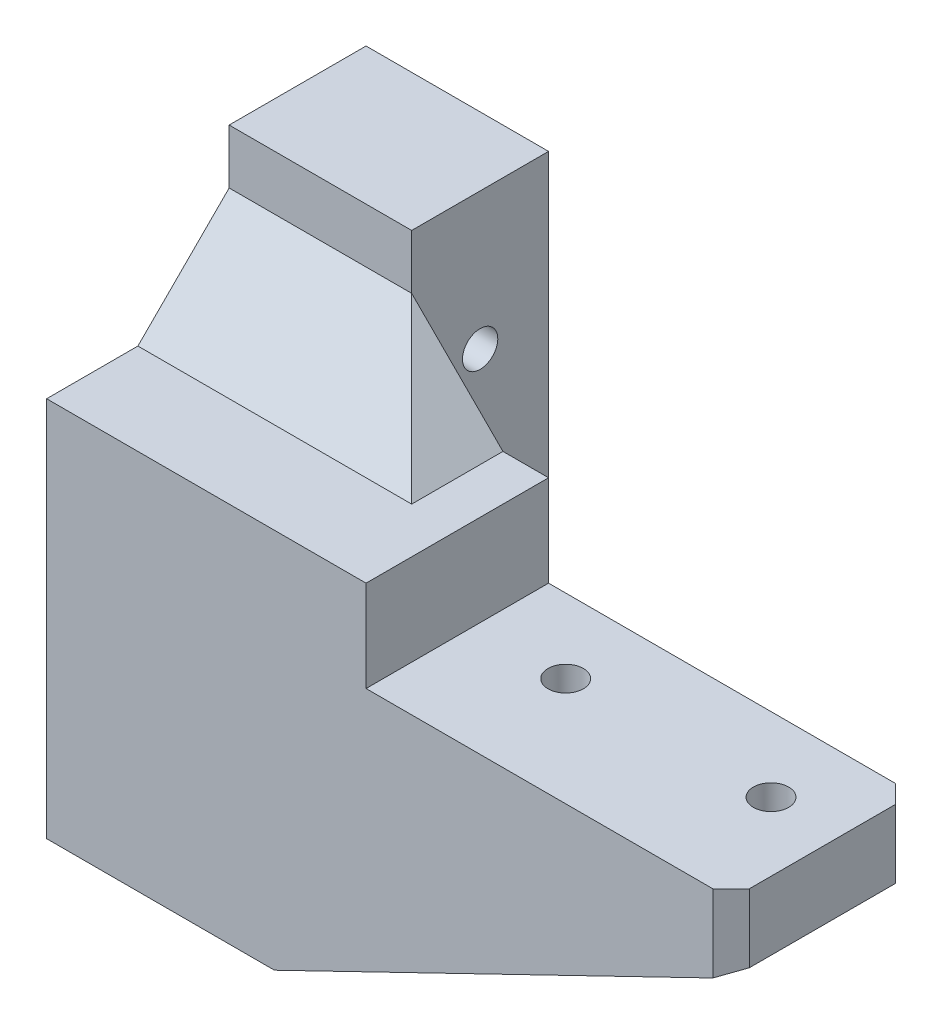
ISO-10303-21;
HEADER;
FILE_DESCRIPTION(('STEP AP214'),'2;1');
FILE_NAME('part.step','',(''),(''),'','','');
FILE_SCHEMA(('AUTOMOTIVE_DESIGN { 1 0 10303 214 1 1 1 1 }'));
ENDSEC;
DATA;
#1=APPLICATION_CONTEXT('core data for automotive mechanical design processes');
#2=APPLICATION_PROTOCOL_DEFINITION('international standard','automotive_design',2000,#1);
#3=PRODUCT_CONTEXT('',#1,'mechanical');
#4=PRODUCT('Part','Part','',(#3));
#5=PRODUCT_RELATED_PRODUCT_CATEGORY('part','',(#4));
#6=PRODUCT_DEFINITION_FORMATION('','',#4);
#7=PRODUCT_DEFINITION_CONTEXT('part definition',#1,'design');
#8=PRODUCT_DEFINITION('design','',#6,#7);
#9=PRODUCT_DEFINITION_SHAPE('','',#8);
#10=(LENGTH_UNIT() NAMED_UNIT(*) SI_UNIT(.MILLI.,.METRE.));
#11=(NAMED_UNIT(*) PLANE_ANGLE_UNIT() SI_UNIT($,.RADIAN.));
#12=(NAMED_UNIT(*) SI_UNIT($,.STERADIAN.) SOLID_ANGLE_UNIT());
#13=UNCERTAINTY_MEASURE_WITH_UNIT(LENGTH_MEASURE(1.E-05),#10,'distance_accuracy_value','');
#14=(GEOMETRIC_REPRESENTATION_CONTEXT(3) GLOBAL_UNCERTAINTY_ASSIGNED_CONTEXT((#13)) GLOBAL_UNIT_ASSIGNED_CONTEXT((#10,
#11,#12)) REPRESENTATION_CONTEXT('',''));
#15=CARTESIAN_POINT('',(0.,0.,0.));
#16=DIRECTION('',(0.,0.,1.));
#17=DIRECTION('',(1.,0.,0.));
#18=AXIS2_PLACEMENT_3D('',#15,#16,#17);
#19=CARTESIAN_POINT('',(95.2499999999948,-202.564999999986,33.3375000000001));
#20=DIRECTION('',(0.,0.707106781186556,0.707106781186546));
#21=DIRECTION('',(1.,0.,0.));
#22=AXIS2_PLACEMENT_3D('',#19,#20,#21);
#23=PLANE('',#22);
#24=CARTESIAN_POINT('',(85.7250000000001,-198.596249999989,29.3687500000002));
#25=DIRECTION('',(0.,-0.707106781186556,-0.707106781186546));
#26=DIRECTION('',(0.,0.707106781186545,-0.707106781186552));
#27=AXIS2_PLACEMENT_3D('',#24,#25,#26);
#28=ELLIPSE('',#27,8.9802561210691,6.35);
#29=CARTESIAN_POINT('',(90.6819671612285,-202.564999999988,33.3375));
#30=VERTEX_POINT('',#29);
#31=CARTESIAN_POINT('',(80.7680328387735,-202.564999999989,33.3374999999999));
#32=VERTEX_POINT('',#31);
#33=EDGE_CURVE('E182',#30,#32,#28,.T.);
#34=ORIENTED_EDGE('',*,*,#33,.F.);
#35=DIRECTION('',(1.,0.,0.));
#36=VECTOR('',#35,1.);
#37=CARTESIAN_POINT('',(95.2499999999948,-202.564999999986,33.3375000000001));
#38=LINE('',#37,#36);
#39=CARTESIAN_POINT('',(95.2499999999948,-202.564999999986,33.3375000000001));
#40=VERTEX_POINT('',#39);
#41=EDGE_CURVE('E179',#30,#40,#38,.T.);
#42=ORIENTED_EDGE('',*,*,#41,.T.);
#43=DIRECTION('',(-0.824876446835019,-0.399736692997301,0.399736692997305));
#44=VECTOR('',#43,1.);
#45=CARTESIAN_POINT('',(95.2499999999948,-202.564999999986,33.3375000000001));
#46=LINE('',#45,#44);
#47=CARTESIAN_POINT('',(82.146460772397,-208.914999999989,39.6874999999997));
#48=VERTEX_POINT('',#47);
#49=EDGE_CURVE('E11',#40,#48,#46,.T.);
#50=ORIENTED_EDGE('',*,*,#49,.T.);
#51=DIRECTION('',(-1.,0.,0.));
#52=VECTOR('',#51,1.);
#53=CARTESIAN_POINT('',(0.,-208.914999999988,39.6874999999998));
#54=LINE('',#53,#52);
#55=CARTESIAN_POINT('',(44.8225263736664,-208.914999999988,39.6874999999996));
#56=VERTEX_POINT('',#55);
#57=EDGE_CURVE('E359',#48,#56,#54,.T.);
#58=ORIENTED_EDGE('',*,*,#57,.T.);
#59=DIRECTION('',(0.41596662095865,0.643028681416405,-0.64302868141641));
#60=VECTOR('',#59,1.);
#61=CARTESIAN_POINT('',(48.9302561210705,-202.564999999988,33.3375));
#62=LINE('',#61,#60);
#63=CARTESIAN_POINT('',(48.9302561210705,-202.564999999988,33.3375));
#64=VERTEX_POINT('',#63);
#65=EDGE_CURVE('E316',#56,#64,#62,.T.);
#66=ORIENTED_EDGE('',*,*,#65,.T.);
#67=CARTESIAN_POINT('',(52.1930328387672,-202.564999999985,33.3375000000001));
#68=VERTEX_POINT('',#67);
#69=EDGE_CURVE('E187',#64,#68,#38,.T.);
#70=ORIENTED_EDGE('',*,*,#69,.T.);
#71=CARTESIAN_POINT('',(57.1500000000001,-198.596249999988,29.3687500000001));
#72=DIRECTION('',(0.,-0.707106781186556,-0.707106781186546));
#73=DIRECTION('',(0.,0.707106781186545,-0.707106781186552));
#74=AXIS2_PLACEMENT_3D('',#71,#72,#73);
#75=ELLIPSE('',#74,8.98025612106912,6.35000000000001);
#76=CARTESIAN_POINT('',(62.1069671612249,-202.564999999988,33.3375000000001));
#77=VERTEX_POINT('',#76);
#78=EDGE_CURVE('E186',#77,#68,#75,.T.);
#79=ORIENTED_EDGE('',*,*,#78,.F.);
#80=EDGE_CURVE('E175',#77,#32,#38,.T.);
#81=ORIENTED_EDGE('',*,*,#80,.T.);
#82=EDGE_LOOP('',(#34,#42,#50,#58,#66,#70,#79,#81));
#83=FACE_BOUND('',#82,.T.);
#84=ADVANCED_FACE('F33',(#83),#23,.F.);
#85=CARTESIAN_POINT('',(25.399999999995,-160.055836743415,44.4500000000005));
#86=DIRECTION('',(0.,1.,0.));
#87=DIRECTION('',(0.,0.,-1.));
#88=AXIS2_PLACEMENT_3D('',#85,#86,#87);
#89=PLANE('',#88);
#90=DIRECTION('',(0.,0.,-1.));
#91=VECTOR('',#90,1.);
#92=CARTESIAN_POINT('',(25.399999999995,-160.055836743415,44.4500000000005));
#93=LINE('',#92,#91);
#94=CARTESIAN_POINT('',(25.399999999995,-160.055836743415,19.0500000000005));
#95=VERTEX_POINT('',#94);
#96=CARTESIAN_POINT('',(25.399999999995,-160.055836743415,0.));
#97=VERTEX_POINT('',#96);
#98=EDGE_CURVE('E301',#95,#97,#93,.T.);
#99=ORIENTED_EDGE('',*,*,#98,.T.);
#100=DIRECTION('',(-1.,0.,0.));
#101=VECTOR('',#100,1.);
#102=CARTESIAN_POINT('',(25.399999999995,-160.055836743415,0.));
#103=LINE('',#102,#101);
#104=CARTESIAN_POINT('',(0.,-160.055836743415,-2.4980018054066E-13));
#105=VERTEX_POINT('',#104);
#106=EDGE_CURVE('E285',#97,#105,#103,.T.);
#107=ORIENTED_EDGE('',*,*,#106,.T.);
#108=DIRECTION('',(0.,0.,-1.));
#109=VECTOR('',#108,1.);
#110=CARTESIAN_POINT('',(0.,-160.055836743415,44.4499999999998));
#111=LINE('',#110,#109);
#112=CARTESIAN_POINT('',(0.,-160.055836743415,19.0499999999998));
#113=VERTEX_POINT('',#112);
#114=EDGE_CURVE('E297',#113,#105,#111,.T.);
#115=ORIENTED_EDGE('',*,*,#114,.F.);
#116=DIRECTION('',(-1.,0.,0.));
#117=VECTOR('',#116,1.);
#118=CARTESIAN_POINT('',(60.3249999999998,-160.055836743415,19.0499999999998));
#119=LINE('',#118,#117);
#120=EDGE_CURVE('E227',#95,#113,#119,.T.);
#121=ORIENTED_EDGE('',*,*,#120,.F.);
#122=EDGE_LOOP('',(#99,#107,#115,#121));
#123=FACE_BOUND('',#122,.T.);
#124=ADVANCED_FACE('F393',(#123),#89,.T.);
#125=CARTESIAN_POINT('',(31.6978347460992,-233.362499999998,19.05));
#126=DIRECTION('',(0.965925826289074,-0.258819045102523,0.));
#127=DIRECTION('',(0.258819045102522,0.965925826289074,0.));
#128=AXIS2_PLACEMENT_3D('',#125,#126,#127);
#129=PLANE('',#128);
#130=DIRECTION('',(0.258819045102522,0.965925826289074,0.));
#131=VECTOR('',#130,1.);
#132=CARTESIAN_POINT('',(31.6978347460992,-233.362499999998,33.3375000000001));
#133=LINE('',#132,#131);
#134=CARTESIAN_POINT('',(31.6978347460992,-233.362499999998,33.3375000000001));
#135=VERTEX_POINT('',#134);
#136=CARTESIAN_POINT('',(38.3064990635998,-208.698628996924,33.3374999999997));
#137=VERTEX_POINT('',#136);
#138=EDGE_CURVE('E353',#135,#137,#133,.T.);
#139=ORIENTED_EDGE('',*,*,#138,.F.);
#140=DIRECTION('',(0.,0.,1.));
#141=VECTOR('',#140,1.);
#142=CARTESIAN_POINT('',(31.6978347460992,-233.362499999998,19.05));
#143=LINE('',#142,#141);
#144=CARTESIAN_POINT('',(31.6978347460992,-233.362499999998,19.05));
#145=VERTEX_POINT('',#144);
#146=EDGE_CURVE('E274',#145,#135,#143,.T.);
#147=ORIENTED_EDGE('',*,*,#146,.F.);
#148=DIRECTION('',(-0.258819045102522,-0.965925826289069,0.));
#149=VECTOR('',#148,1.);
#150=CARTESIAN_POINT('',(31.6978347460992,-233.362499999998,19.05));
#151=LINE('',#150,#149);
#152=CARTESIAN_POINT('',(38.3064990635997,-208.698628996924,19.0500000000001));
#153=VERTEX_POINT('',#152);
#154=EDGE_CURVE('E253',#153,#145,#151,.T.);
#155=ORIENTED_EDGE('',*,*,#154,.F.);
#156=DIRECTION('',(0.,0.,-1.));
#157=VECTOR('',#156,1.);
#158=CARTESIAN_POINT('',(38.3064990635997,-208.698628996924,19.0500000000001));
#159=LINE('',#158,#157);
#160=EDGE_CURVE('E356',#137,#153,#159,.T.);
#161=ORIENTED_EDGE('',*,*,#160,.F.);
#162=EDGE_LOOP('',(#139,#147,#155,#161));
#163=FACE_BOUND('',#162,.T.);
#164=ADVANCED_FACE('F397',(#163),#129,.T.);
#165=CARTESIAN_POINT('',(95.2499999999948,-202.564999999986,19.0500000000001));
#166=DIRECTION('',(0.,-1.,0.));
#167=DIRECTION('',(0.,0.,1.));
#168=AXIS2_PLACEMENT_3D('',#165,#166,#167);
#169=PLANE('',#168);
#170=CARTESIAN_POINT('',(85.7250000000001,-202.564999999989,29.36875));
#171=DIRECTION('',(0.,1.,0.));
#172=DIRECTION('',(0.,0.,1.));
#173=AXIS2_PLACEMENT_3D('',#170,#171,#172);
#174=CIRCLE('',#173,2.45744999999999);
#175=CARTESIAN_POINT('',(85.7250000000001,-202.564999999989,31.8262));
#176=VERTEX_POINT('',#175);
#177=EDGE_CURVE('E181',#176,#176,#174,.T.);
#178=ORIENTED_EDGE('',*,*,#177,.T.);
#179=EDGE_LOOP('',(#178));
#180=FACE_BOUND('',#179,.T.);
#181=CARTESIAN_POINT('',(57.15,-202.564999999989,29.36875));
#182=DIRECTION('',(0.,1.,0.));
#183=DIRECTION('',(0.,0.,1.));
#184=AXIS2_PLACEMENT_3D('',#181,#182,#183);
#185=CIRCLE('',#184,2.45744999999999);
#186=CARTESIAN_POINT('',(57.15,-202.564999999989,31.8262));
#187=VERTEX_POINT('',#186);
#188=EDGE_CURVE('E196',#187,#187,#185,.T.);
#189=ORIENTED_EDGE('',*,*,#188,.T.);
#190=EDGE_LOOP('',(#189));
#191=FACE_BOUND('',#190,.T.);
#192=DIRECTION('',(-1.,0.,0.));
#193=VECTOR('',#192,1.);
#194=CARTESIAN_POINT('',(95.2499999999948,-202.564999999986,19.0500000000001));
#195=LINE('',#194,#193);
#196=CARTESIAN_POINT('',(92.7100000000003,-202.564999999989,19.05));
#197=VERTEX_POINT('',#196);
#198=CARTESIAN_POINT('',(48.9302561210705,-202.564999999988,19.05));
#199=VERTEX_POINT('',#198);
#200=EDGE_CURVE('E249',#197,#199,#195,.T.);
#201=ORIENTED_EDGE('',*,*,#200,.F.);
#202=DIRECTION('',(-0.707106781186552,0.,-0.707106781186547));
#203=VECTOR('',#202,1.);
#204=CARTESIAN_POINT('',(93.9800000000002,-202.564999999989,20.3200000000001));
#205=LINE('',#204,#203);
#206=CARTESIAN_POINT('',(95.2499999999948,-202.564999999986,21.5900000000002));
#207=VERTEX_POINT('',#206);
#208=EDGE_CURVE('E345',#207,#197,#205,.T.);
#209=ORIENTED_EDGE('',*,*,#208,.F.);
#210=DIRECTION('',(0.,0.,1.));
#211=VECTOR('',#210,1.);
#212=CARTESIAN_POINT('',(95.2499999999948,-202.564999999986,19.0500000000001));
#213=LINE('',#212,#211);
#214=EDGE_CURVE('E277',#207,#40,#213,.T.);
#215=ORIENTED_EDGE('',*,*,#214,.T.);
#216=ORIENTED_EDGE('',*,*,#41,.F.);
#217=CARTESIAN_POINT('',(85.7250000000001,-202.564999999989,29.36875));
#218=DIRECTION('',(0.,1.,0.));
#219=DIRECTION('',(0.,0.,1.));
#220=AXIS2_PLACEMENT_3D('',#217,#218,#219);
#221=CIRCLE('',#220,6.35);
#222=EDGE_CURVE('E48',#32,#30,#221,.T.);
#223=ORIENTED_EDGE('',*,*,#222,.F.);
#224=ORIENTED_EDGE('',*,*,#80,.F.);
#225=CARTESIAN_POINT('',(57.15,-202.564999999989,29.36875));
#226=DIRECTION('',(0.,1.,0.));
#227=DIRECTION('',(0.,0.,1.));
#228=AXIS2_PLACEMENT_3D('',#225,#226,#227);
#229=CIRCLE('',#228,6.35000000000001);
#230=EDGE_CURVE('E55',#68,#77,#229,.T.);
#231=ORIENTED_EDGE('',*,*,#230,.F.);
#232=ORIENTED_EDGE('',*,*,#69,.F.);
#233=DIRECTION('',(0.,0.,1.));
#234=VECTOR('',#233,1.);
#235=CARTESIAN_POINT('',(48.9302561210705,-202.564999999988,39.6875000000001));
#236=LINE('',#235,#234);
#237=EDGE_CURVE('E350',#199,#64,#236,.T.);
#238=ORIENTED_EDGE('',*,*,#237,.F.);
#239=EDGE_LOOP('',(#201,#209,#215,#216,#223,#224,#231,#232,#238));
#240=FACE_BOUND('',#239,.T.);
#241=ADVANCED_FACE('F174',(#180,#191,#240),#169,.T.);
#242=CARTESIAN_POINT('',(25.399999999995,-160.055836743415,44.4500000000005));
#243=DIRECTION('',(1.,0.,0.));
#244=DIRECTION('',(0.,1.00000000000001,0.));
#245=AXIS2_PLACEMENT_3D('',#242,#243,#244);
#246=PLANE('',#245);
#247=CARTESIAN_POINT('',(25.3999999999976,-214.312500000004,9.52499999999959));
#248=DIRECTION('',(-1.,0.,0.));
#249=DIRECTION('',(0.,1.00000000000001,0.));
#250=AXIS2_PLACEMENT_3D('',#247,#248,#249);
#251=CIRCLE('',#250,2.45744999999999);
#252=CARTESIAN_POINT('',(25.3999999999976,-211.855050000004,9.52499999999959));
#253=VERTEX_POINT('',#252);
#254=EDGE_CURVE('E203',#253,#253,#251,.T.);
#255=ORIENTED_EDGE('',*,*,#254,.T.);
#256=EDGE_LOOP('',(#255));
#257=FACE_BOUND('',#256,.T.);
#258=CARTESIAN_POINT('',(25.3999999999995,-179.105836743418,9.52499999999998));
#259=DIRECTION('',(-1.,0.,0.));
#260=DIRECTION('',(0.,1.00000000000001,0.));
#261=AXIS2_PLACEMENT_3D('',#258,#259,#260);
#262=CIRCLE('',#261,2.45744999999999);
#263=CARTESIAN_POINT('',(25.3999999999995,-176.648386743418,9.52499999999998));
#264=VERTEX_POINT('',#263);
#265=EDGE_CURVE('E208',#264,#264,#262,.T.);
#266=ORIENTED_EDGE('',*,*,#265,.T.);
#267=EDGE_LOOP('',(#266));
#268=FACE_BOUND('',#267,.T.);
#269=DIRECTION('',(0.,1.00000000000001,0.));
#270=VECTOR('',#269,1.);
#271=CARTESIAN_POINT('',(25.4000000000003,-233.362500000001,19.0499999999999));
#272=LINE('',#271,#270);
#273=CARTESIAN_POINT('',(25.4000000000003,-233.362500000001,19.0499999999999));
#274=VERTEX_POINT('',#273);
#275=CARTESIAN_POINT('',(25.4000000000003,-167.639999999989,19.05));
#276=VERTEX_POINT('',#275);
#277=EDGE_CURVE('E259',#274,#276,#272,.T.);
#278=ORIENTED_EDGE('',*,*,#277,.F.);
#279=DIRECTION('',(0.,0.,-1.));
#280=VECTOR('',#279,1.);
#281=CARTESIAN_POINT('',(25.4000000000003,-233.362500000001,44.4499999999999));
#282=LINE('',#281,#280);
#283=CARTESIAN_POINT('',(25.4000000000003,-233.362500000001,-2.4980018054066E-13));
#284=VERTEX_POINT('',#283);
#285=EDGE_CURVE('E304',#274,#284,#282,.T.);
#286=ORIENTED_EDGE('',*,*,#285,.T.);
#287=DIRECTION('',(0.,1.00000000000001,0.));
#288=VECTOR('',#287,1.);
#289=CARTESIAN_POINT('',(25.399999999995,-160.055836743415,0.));
#290=LINE('',#289,#288);
#291=EDGE_CURVE('E293',#284,#97,#290,.T.);
#292=ORIENTED_EDGE('',*,*,#291,.T.);
#293=ORIENTED_EDGE('',*,*,#98,.F.);
#294=EDGE_CURVE('E258',#276,#95,#272,.T.);
#295=ORIENTED_EDGE('',*,*,#294,.F.);
#296=EDGE_LOOP('',(#278,#286,#292,#293,#295));
#297=FACE_BOUND('',#296,.T.);
#298=ADVANCED_FACE('F409',(#257,#268,#297),#246,.T.);
#299=CARTESIAN_POINT('',(0.,-160.055836743415,44.4499999999998));
#300=DIRECTION('',(-1.,0.,0.));
#301=DIRECTION('',(0.,-1.,0.));
#302=AXIS2_PLACEMENT_3D('',#299,#300,#301);
#303=PLANE('',#302);
#304=CARTESIAN_POINT('',(0.,-179.105836743417,9.52500000000006));
#305=DIRECTION('',(1.,0.,0.));
#306=DIRECTION('',(0.,0.,-1.));
#307=AXIS2_PLACEMENT_3D('',#304,#305,#306);
#308=CIRCLE('',#307,2.95910000000002);
#309=CARTESIAN_POINT('',(0.,-179.105836743417,6.56590000000004));
#310=VERTEX_POINT('',#309);
#311=EDGE_CURVE('E211',#310,#310,#308,.T.);
#312=ORIENTED_EDGE('',*,*,#311,.T.);
#313=EDGE_LOOP('',(#312));
#314=FACE_BOUND('',#313,.T.);
#315=CARTESIAN_POINT('',(-8.60422844084496E-13,-214.312500000004,9.5249999999997));
#316=DIRECTION('',(1.,0.,0.));
#317=DIRECTION('',(0.,0.,-1.));
#318=AXIS2_PLACEMENT_3D('',#315,#316,#317);
#319=CIRCLE('',#318,2.95910000000002);
#320=CARTESIAN_POINT('',(-8.6107989627493E-13,-214.312500000004,6.56589999999967));
#321=VERTEX_POINT('',#320);
#322=EDGE_CURVE('E217',#321,#321,#319,.T.);
#323=ORIENTED_EDGE('',*,*,#322,.T.);
#324=EDGE_LOOP('',(#323));
#325=FACE_BOUND('',#324,.T.);
#326=DIRECTION('',(0.,-1.,0.));
#327=VECTOR('',#326,1.);
#328=CARTESIAN_POINT('',(-7.06379399417756E-12,-180.339999999986,19.05));
#329=LINE('',#328,#327);
#330=CARTESIAN_POINT('',(-3.5527136788005E-12,-167.639999999987,19.0499999999997));
#331=VERTEX_POINT('',#330);
#332=EDGE_CURVE('E224',#113,#331,#329,.T.);
#333=ORIENTED_EDGE('',*,*,#332,.F.);
#334=ORIENTED_EDGE('',*,*,#114,.T.);
#335=DIRECTION('',(0.,-1.,0.));
#336=VECTOR('',#335,1.);
#337=CARTESIAN_POINT('',(0.,-160.055836743415,-2.4980018054066E-13));
#338=LINE('',#337,#336);
#339=CARTESIAN_POINT('',(0.,-233.3625,0.));
#340=VERTEX_POINT('',#339);
#341=EDGE_CURVE('E271',#105,#340,#338,.T.);
#342=ORIENTED_EDGE('',*,*,#341,.T.);
#343=DIRECTION('',(0.,0.,-1.));
#344=VECTOR('',#343,1.);
#345=CARTESIAN_POINT('',(0.,-233.3625,44.45));
#346=LINE('',#345,#344);
#347=CARTESIAN_POINT('',(0.,-233.3625,44.45));
#348=VERTEX_POINT('',#347);
#349=EDGE_CURVE('E288',#348,#340,#346,.T.);
#350=ORIENTED_EDGE('',*,*,#349,.F.);
#351=DIRECTION('',(0.,-1.,0.));
#352=VECTOR('',#351,1.);
#353=CARTESIAN_POINT('',(0.,-160.055836743415,44.4499999999998));
#354=LINE('',#353,#352);
#355=CARTESIAN_POINT('',(-7.105427357601E-12,-180.339999999986,44.4500000000001));
#356=VERTEX_POINT('',#355);
#357=EDGE_CURVE('E281',#356,#348,#354,.T.);
#358=ORIENTED_EDGE('',*,*,#357,.F.);
#359=DIRECTION('',(0.,0.,1.));
#360=VECTOR('',#359,1.);
#361=CARTESIAN_POINT('',(-7.11930514540882E-12,-180.339999999986,-44.5939541827765));
#362=LINE('',#361,#360);
#363=CARTESIAN_POINT('',(-7.11930514540882E-12,-180.339999999986,31.7500000000001));
#364=VERTEX_POINT('',#363);
#365=EDGE_CURVE('E228',#364,#356,#362,.T.);
#366=ORIENTED_EDGE('',*,*,#365,.F.);
#367=DIRECTION('',(0.,-0.707106781186545,0.707106781186551));
#368=VECTOR('',#367,1.);
#369=CARTESIAN_POINT('',(-7.11930514540882E-12,-180.339999999986,31.7500000000001));
#370=LINE('',#369,#368);
#371=EDGE_CURVE('E321',#331,#364,#370,.T.);
#372=ORIENTED_EDGE('',*,*,#371,.F.);
#373=EDGE_LOOP('',(#333,#334,#342,#350,#358,#366,#372));
#374=FACE_BOUND('',#373,.T.);
#375=ADVANCED_FACE('F412',(#314,#325,#374),#303,.T.);
#376=CARTESIAN_POINT('',(25.4000000000003,-233.362500000001,44.4499999999999));
#377=DIRECTION('',(0.,-1.,0.));
#378=DIRECTION('',(0.,0.,1.));
#379=AXIS2_PLACEMENT_3D('',#376,#377,#378);
#380=PLANE('',#379);
#381=DIRECTION('',(1.,0.,0.));
#382=VECTOR('',#381,1.);
#383=CARTESIAN_POINT('',(25.4000000000003,-233.362500000001,-2.4980018054066E-13));
#384=LINE('',#383,#382);
#385=EDGE_CURVE('E291',#340,#284,#384,.T.);
#386=ORIENTED_EDGE('',*,*,#385,.T.);
#387=ORIENTED_EDGE('',*,*,#285,.F.);
#388=DIRECTION('',(-1.,0.,0.));
#389=VECTOR('',#388,1.);
#390=CARTESIAN_POINT('',(25.4000000000003,-233.362500000001,19.0499999999999));
#391=LINE('',#390,#389);
#392=EDGE_CURVE('E256',#145,#274,#391,.T.);
#393=ORIENTED_EDGE('',*,*,#392,.F.);
#394=ORIENTED_EDGE('',*,*,#146,.T.);
#395=DIRECTION('',(0.,0.,1.));
#396=VECTOR('',#395,1.);
#397=CARTESIAN_POINT('',(31.6978347460992,-233.362499999998,39.6875000000001));
#398=LINE('',#397,#396);
#399=CARTESIAN_POINT('',(31.6978347460992,-233.362499999999,44.4500000000001));
#400=VERTEX_POINT('',#399);
#401=EDGE_CURVE('E238',#135,#400,#398,.T.);
#402=ORIENTED_EDGE('',*,*,#401,.T.);
#403=DIRECTION('',(1.,0.,0.));
#404=VECTOR('',#403,1.);
#405=CARTESIAN_POINT('',(25.4000000000003,-233.362500000001,44.4499999999999));
#406=LINE('',#405,#404);
#407=EDGE_CURVE('E284',#348,#400,#406,.T.);
#408=ORIENTED_EDGE('',*,*,#407,.F.);
#409=ORIENTED_EDGE('',*,*,#349,.T.);
#410=EDGE_LOOP('',(#386,#387,#393,#394,#402,#408,#409));
#411=FACE_BOUND('',#410,.T.);
#412=ADVANCED_FACE('F414',(#411),#380,.T.);
#413=CARTESIAN_POINT('',(0.,0.,44.4499999999999));
#414=DIRECTION('',(0.,0.,1.));
#415=DIRECTION('',(-1.,0.,0.));
#416=AXIS2_PLACEMENT_3D('',#413,#414,#415);
#417=PLANE('',#416);
#418=DIRECTION('',(1.,0.,0.));
#419=VECTOR('',#418,1.);
#420=CARTESIAN_POINT('',(44.4500000000003,-193.039999999989,44.4500000000002));
#421=LINE('',#420,#419);
#422=CARTESIAN_POINT('',(44.4500000000003,-193.039999999989,44.4500000000002));
#423=VERTEX_POINT('',#422);
#424=CARTESIAN_POINT('',(92.7099999999994,-193.039999999988,44.4500000000001));
#425=VERTEX_POINT('',#424);
#426=EDGE_CURVE('E243',#423,#425,#421,.T.);
#427=ORIENTED_EDGE('',*,*,#426,.F.);
#428=DIRECTION('',(0.,-1.,0.));
#429=VECTOR('',#428,1.);
#430=CARTESIAN_POINT('',(44.4500000000003,-193.039999999989,44.4500000000002));
#431=LINE('',#430,#429);
#432=CARTESIAN_POINT('',(44.4499999999968,-180.339999999986,44.4500000000001));
#433=VERTEX_POINT('',#432);
#434=EDGE_CURVE('E250',#433,#423,#431,.T.);
#435=ORIENTED_EDGE('',*,*,#434,.F.);
#436=DIRECTION('',(-1.,0.,0.));
#437=VECTOR('',#436,1.);
#438=CARTESIAN_POINT('',(60.3249999999971,-180.339999999986,44.4500000000002));
#439=LINE('',#438,#437);
#440=EDGE_CURVE('E223',#433,#356,#439,.T.);
#441=ORIENTED_EDGE('',*,*,#440,.T.);
#442=ORIENTED_EDGE('',*,*,#357,.T.);
#443=ORIENTED_EDGE('',*,*,#407,.T.);
#444=DIRECTION('',(-0.89990120040365,-0.436093831086931,0.));
#445=VECTOR('',#444,1.);
#446=CARTESIAN_POINT('',(31.6978347460992,-233.362499999999,44.4500000000001));
#447=LINE('',#446,#445);
#448=CARTESIAN_POINT('',(92.7100000000003,-203.795888824744,44.4500000000001));
#449=VERTEX_POINT('',#448);
#450=EDGE_CURVE('E231',#449,#400,#447,.T.);
#451=ORIENTED_EDGE('',*,*,#450,.F.);
#452=DIRECTION('',(0.,-1.,0.));
#453=VECTOR('',#452,1.);
#454=CARTESIAN_POINT('',(92.7099999999994,2.22044604925031E-13,44.4500000000004));
#455=LINE('',#454,#453);
#456=EDGE_CURVE('E331',#425,#449,#455,.T.);
#457=ORIENTED_EDGE('',*,*,#456,.F.);
#458=EDGE_LOOP('',(#427,#435,#441,#442,#443,#451,#457));
#459=FACE_BOUND('',#458,.T.);
#460=ADVANCED_FACE('F417',(#459),#417,.T.);
#461=CARTESIAN_POINT('',(0.,0.,0.));
#462=DIRECTION('',(0.,0.,1.));
#463=DIRECTION('',(-1.,0.,0.));
#464=AXIS2_PLACEMENT_3D('',#461,#462,#463);
#465=PLANE('',#464);
#466=ORIENTED_EDGE('',*,*,#341,.F.);
#467=ORIENTED_EDGE('',*,*,#106,.F.);
#468=ORIENTED_EDGE('',*,*,#291,.F.);
#469=ORIENTED_EDGE('',*,*,#385,.F.);
#470=EDGE_LOOP('',(#466,#467,#468,#469));
#471=FACE_BOUND('',#470,.T.);
#472=ADVANCED_FACE('F407',(#471),#465,.F.);
#473=CARTESIAN_POINT('',(44.4500000000004,-193.039999999989,19.0500000000002));
#474=DIRECTION('',(0.,1.,0.));
#475=DIRECTION('',(0.,0.,-1.));
#476=AXIS2_PLACEMENT_3D('',#473,#474,#475);
#477=PLANE('',#476);
#478=CARTESIAN_POINT('',(85.724999999993,-193.039999999987,29.36875));
#479=DIRECTION('',(0.,-1.,0.));
#480=DIRECTION('',(0.,0.,-1.));
#481=AXIS2_PLACEMENT_3D('',#478,#479,#480);
#482=CIRCLE('',#481,2.45744999999999);
#483=CARTESIAN_POINT('',(85.724999999993,-193.039999999987,26.9113));
#484=VERTEX_POINT('',#483);
#485=EDGE_CURVE('E36',#484,#484,#482,.T.);
#486=ORIENTED_EDGE('',*,*,#485,.T.);
#487=EDGE_LOOP('',(#486));
#488=FACE_BOUND('',#487,.T.);
#489=CARTESIAN_POINT('',(57.1499999999859,-193.039999999985,29.3687500000001));
#490=DIRECTION('',(0.,-1.,0.));
#491=DIRECTION('',(0.,0.,-1.));
#492=AXIS2_PLACEMENT_3D('',#489,#490,#491);
#493=CIRCLE('',#492,2.45744999999999);
#494=CARTESIAN_POINT('',(57.1499999999859,-193.039999999985,26.9113000000001));
#495=VERTEX_POINT('',#494);
#496=EDGE_CURVE('E199',#495,#495,#493,.T.);
#497=ORIENTED_EDGE('',*,*,#496,.T.);
#498=EDGE_LOOP('',(#497));
#499=FACE_BOUND('',#498,.T.);
#500=DIRECTION('',(0.,0.,1.));
#501=VECTOR('',#500,1.);
#502=CARTESIAN_POINT('',(95.2499999999841,-193.039999999988,19.0500000000003));
#503=LINE('',#502,#501);
#504=CARTESIAN_POINT('',(95.2499999999841,-193.039999999988,21.5900000000002));
#505=VERTEX_POINT('',#504);
#506=CARTESIAN_POINT('',(95.2499999999841,-193.039999999988,41.9100000000003));
#507=VERTEX_POINT('',#506);
#508=EDGE_CURVE('E264',#505,#507,#503,.T.);
#509=ORIENTED_EDGE('',*,*,#508,.F.);
#510=DIRECTION('',(0.707106781186552,0.,0.707106781186547));
#511=VECTOR('',#510,1.);
#512=CARTESIAN_POINT('',(68.5799999999972,-193.039999999989,-5.07999999999988));
#513=LINE('',#512,#511);
#514=CARTESIAN_POINT('',(92.7099999999994,-193.039999999988,19.0500000000001));
#515=VERTEX_POINT('',#514);
#516=EDGE_CURVE('E340',#515,#505,#513,.T.);
#517=ORIENTED_EDGE('',*,*,#516,.F.);
#518=DIRECTION('',(1.,0.,0.));
#519=VECTOR('',#518,1.);
#520=CARTESIAN_POINT('',(44.4500000000004,-193.039999999989,19.0500000000002));
#521=LINE('',#520,#519);
#522=CARTESIAN_POINT('',(44.4500000000004,-193.039999999989,19.0500000000002));
#523=VERTEX_POINT('',#522);
#524=EDGE_CURVE('E246',#523,#515,#521,.T.);
#525=ORIENTED_EDGE('',*,*,#524,.F.);
#526=DIRECTION('',(0.,0.,1.));
#527=VECTOR('',#526,1.);
#528=CARTESIAN_POINT('',(44.4500000000004,-193.039999999989,19.0500000000002));
#529=LINE('',#528,#527);
#530=EDGE_CURVE('E269',#523,#423,#529,.T.);
#531=ORIENTED_EDGE('',*,*,#530,.T.);
#532=ORIENTED_EDGE('',*,*,#426,.T.);
#533=DIRECTION('',(0.707106781186546,0.,-0.707106781186553));
#534=VECTOR('',#533,1.);
#535=CARTESIAN_POINT('',(81.2799999999996,-193.039999999989,55.8799999999999));
#536=LINE('',#535,#534);
#537=EDGE_CURVE('E343',#507,#425,#536,.F.);
#538=ORIENTED_EDGE('',*,*,#537,.F.);
#539=EDGE_LOOP('',(#509,#517,#525,#531,#532,#538));
#540=FACE_BOUND('',#539,.T.);
#541=ADVANCED_FACE('F486',(#488,#499,#540),#477,.T.);
#542=CARTESIAN_POINT('',(44.4500000000004,-193.039999999989,19.0500000000002));
#543=DIRECTION('',(1.,0.,0.));
#544=DIRECTION('',(0.,1.,0.));
#545=AXIS2_PLACEMENT_3D('',#542,#543,#544);
#546=PLANE('',#545);
#547=ORIENTED_EDGE('',*,*,#434,.T.);
#548=ORIENTED_EDGE('',*,*,#530,.F.);
#549=DIRECTION('',(0.,-1.,0.));
#550=VECTOR('',#549,1.);
#551=CARTESIAN_POINT('',(44.4500000000004,-193.039999999989,19.0500000000002));
#552=LINE('',#551,#550);
#553=CARTESIAN_POINT('',(44.4499999999968,-180.339999999986,19.0500000000001));
#554=VERTEX_POINT('',#553);
#555=EDGE_CURVE('E262',#554,#523,#552,.T.);
#556=ORIENTED_EDGE('',*,*,#555,.F.);
#557=DIRECTION('',(0.,0.,1.));
#558=VECTOR('',#557,1.);
#559=CARTESIAN_POINT('',(44.4499999999968,-180.339999999986,19.0500000000001));
#560=LINE('',#559,#558);
#561=EDGE_CURVE('E272',#554,#433,#560,.T.);
#562=ORIENTED_EDGE('',*,*,#561,.T.);
#563=EDGE_LOOP('',(#547,#548,#556,#562));
#564=FACE_BOUND('',#563,.T.);
#565=ADVANCED_FACE('F484',(#564),#546,.T.);
#566=CARTESIAN_POINT('',(95.2499999999841,-193.039999999988,19.0500000000003));
#567=DIRECTION('',(1.,0.,0.));
#568=DIRECTION('',(0.,0.,1.));
#569=AXIS2_PLACEMENT_3D('',#566,#567,#568);
#570=PLANE('',#569);
#571=DIRECTION('',(0.,0.,1.));
#572=VECTOR('',#571,1.);
#573=CARTESIAN_POINT('',(95.2499999999948,-202.564999999986,39.6875000000001));
#574=LINE('',#573,#572);
#575=CARTESIAN_POINT('',(95.2499999999948,-202.564999999986,41.9100000000001));
#576=VERTEX_POINT('',#575);
#577=EDGE_CURVE('E240',#40,#576,#574,.T.);
#578=ORIENTED_EDGE('',*,*,#577,.F.);
#579=ORIENTED_EDGE('',*,*,#214,.F.);
#580=DIRECTION('',(0.,-1.,0.));
#581=VECTOR('',#580,1.);
#582=CARTESIAN_POINT('',(95.2499999999948,-202.564999999986,21.5900000000002));
#583=LINE('',#582,#581);
#584=EDGE_CURVE('E336',#505,#207,#583,.T.);
#585=ORIENTED_EDGE('',*,*,#584,.F.);
#586=ORIENTED_EDGE('',*,*,#508,.T.);
#587=DIRECTION('',(0.,1.,0.));
#588=VECTOR('',#587,1.);
#589=CARTESIAN_POINT('',(95.2499999999841,-193.039999999988,41.9100000000003));
#590=LINE('',#589,#588);
#591=EDGE_CURVE('E338',#576,#507,#590,.T.);
#592=ORIENTED_EDGE('',*,*,#591,.F.);
#593=EDGE_LOOP('',(#578,#579,#585,#586,#592));
#594=FACE_BOUND('',#593,.T.);
#595=ADVANCED_FACE('F465',(#594),#570,.T.);
#596=CARTESIAN_POINT('',(0.,0.,19.0499999999999));
#597=DIRECTION('',(0.,0.,1.));
#598=DIRECTION('',(-1.,0.,0.));
#599=AXIS2_PLACEMENT_3D('',#596,#597,#598);
#600=PLANE('',#599);
#601=ORIENTED_EDGE('',*,*,#200,.T.);
#602=DIRECTION('',(-0.866025403784444,-0.499999999999996,0.));
#603=VECTOR('',#602,1.);
#604=CARTESIAN_POINT('',(99.9457819890593,-173.111172407256,19.0499999999997));
#605=LINE('',#604,#603);
#606=EDGE_CURVE('E364',#153,#199,#605,.F.);
#607=ORIENTED_EDGE('',*,*,#606,.F.);
#608=ORIENTED_EDGE('',*,*,#154,.T.);
#609=ORIENTED_EDGE('',*,*,#392,.T.);
#610=ORIENTED_EDGE('',*,*,#277,.T.);
#611=DIRECTION('',(-0.707106781186555,0.707106781186548,0.));
#612=VECTOR('',#611,1.);
#613=CARTESIAN_POINT('',(-71.1199999999952,-71.1199999999952,19.0499999999997));
#614=LINE('',#613,#612);
#615=CARTESIAN_POINT('',(38.0999999999903,-180.339999999988,19.05));
#616=VERTEX_POINT('',#615);
#617=EDGE_CURVE('E326',#616,#276,#614,.T.);
#618=ORIENTED_EDGE('',*,*,#617,.F.);
#619=DIRECTION('',(-1.,0.,0.));
#620=VECTOR('',#619,1.);
#621=CARTESIAN_POINT('',(-7.06379399417756E-12,-180.339999999986,19.05));
#622=LINE('',#621,#620);
#623=EDGE_CURVE('E300',#554,#616,#622,.T.);
#624=ORIENTED_EDGE('',*,*,#623,.F.);
#625=ORIENTED_EDGE('',*,*,#555,.T.);
#626=ORIENTED_EDGE('',*,*,#524,.T.);
#627=DIRECTION('',(0.,1.,0.));
#628=VECTOR('',#627,1.);
#629=CARTESIAN_POINT('',(92.7099999999994,-193.039999999988,19.0500000000001));
#630=LINE('',#629,#628);
#631=EDGE_CURVE('E348',#197,#515,#630,.T.);
#632=ORIENTED_EDGE('',*,*,#631,.F.);
#633=EDGE_LOOP('',(#601,#607,#608,#609,#610,#618,#624,#625,#626,#632));
#634=FACE_BOUND('',#633,.T.);
#635=ADVANCED_FACE('F458',(#634),#600,.F.);
#636=CARTESIAN_POINT('',(31.6978347460992,-233.362499999998,39.6875000000001));
#637=DIRECTION('',(0.436093831086932,-0.899901200403649,0.));
#638=DIRECTION('',(0.89990120040365,0.43609383108693,0.));
#639=AXIS2_PLACEMENT_3D('',#636,#637,#638);
#640=PLANE('',#639);
#641=ORIENTED_EDGE('',*,*,#450,.T.);
#642=ORIENTED_EDGE('',*,*,#401,.F.);
#643=DIRECTION('',(-0.717721056951785,-0.347808987517154,-0.603245714953958));
#644=VECTOR('',#643,1.);
#645=CARTESIAN_POINT('',(31.6978347460992,-233.362499999998,33.3375000000001));
#646=LINE('',#645,#644);
#647=CARTESIAN_POINT('',(39.2528469055993,-229.701326756684,39.6875000000006));
#648=VERTEX_POINT('',#647);
#649=EDGE_CURVE('E41',#648,#135,#646,.T.);
#650=ORIENTED_EDGE('',*,*,#649,.F.);
#651=DIRECTION('',(-0.89990120040365,-0.436093831086931,0.));
#652=VECTOR('',#651,1.);
#653=CARTESIAN_POINT('',(31.6978347460992,-233.362499999998,39.6875000000001));
#654=LINE('',#653,#652);
#655=EDGE_CURVE('E235',#48,#648,#654,.T.);
#656=ORIENTED_EDGE('',*,*,#655,.F.);
#657=ORIENTED_EDGE('',*,*,#49,.F.);
#658=ORIENTED_EDGE('',*,*,#577,.T.);
#659=DIRECTION('',(-0.668924155615008,-0.324161916439148,0.668924155615011));
#660=VECTOR('',#659,1.);
#661=CARTESIAN_POINT('',(61.1293352811338,-219.099938935295,76.0306647188669));
#662=LINE('',#661,#660);
#663=EDGE_CURVE('E334',#449,#576,#662,.F.);
#664=ORIENTED_EDGE('',*,*,#663,.F.);
#665=EDGE_LOOP('',(#641,#642,#650,#656,#657,#658,#664));
#666=FACE_BOUND('',#665,.T.);
#667=ADVANCED_FACE('F452',(#666),#640,.T.);
#668=CARTESIAN_POINT('',(0.,0.,39.6874999999999));
#669=DIRECTION('',(0.,0.,1.));
#670=DIRECTION('',(-1.,0.,0.));
#671=AXIS2_PLACEMENT_3D('',#668,#669,#670);
#672=PLANE('',#671);
#673=ORIENTED_EDGE('',*,*,#57,.F.);
#674=ORIENTED_EDGE('',*,*,#655,.T.);
#675=DIRECTION('',(-0.258819045102522,-0.965925826289074,0.));
#676=VECTOR('',#675,1.);
#677=CARTESIAN_POINT('',(94.0487364375287,-25.2002829776026,39.6875000000004));
#678=LINE('',#677,#676);
#679=EDGE_CURVE('E362',#56,#648,#678,.T.);
#680=ORIENTED_EDGE('',*,*,#679,.F.);
#681=EDGE_LOOP('',(#673,#674,#680));
#682=FACE_BOUND('',#681,.T.);
#683=ADVANCED_FACE('F468',(#682),#672,.F.);
#684=CARTESIAN_POINT('',(60.3249999999971,-180.339999999987,-44.5939541827764));
#685=DIRECTION('',(0.,-1.,0.));
#686=DIRECTION('',(0.,0.,1.));
#687=AXIS2_PLACEMENT_3D('',#684,#685,#686);
#688=PLANE('',#687);
#689=DIRECTION('',(1.,0.,0.));
#690=VECTOR('',#689,1.);
#691=CARTESIAN_POINT('',(60.3249999999971,-180.339999999986,31.7500000000002));
#692=LINE('',#691,#690);
#693=CARTESIAN_POINT('',(38.0999999999903,-180.339999999988,31.7500000000002));
#694=VERTEX_POINT('',#693);
#695=EDGE_CURVE('E311',#364,#694,#692,.T.);
#696=ORIENTED_EDGE('',*,*,#695,.F.);
#697=ORIENTED_EDGE('',*,*,#365,.T.);
#698=ORIENTED_EDGE('',*,*,#440,.F.);
#699=ORIENTED_EDGE('',*,*,#561,.F.);
#700=ORIENTED_EDGE('',*,*,#623,.T.);
#701=DIRECTION('',(0.,0.,-1.));
#702=VECTOR('',#701,1.);
#703=CARTESIAN_POINT('',(38.0999999999903,-180.339999999988,-44.5939541827765));
#704=LINE('',#703,#702);
#705=EDGE_CURVE('E324',#694,#616,#704,.T.);
#706=ORIENTED_EDGE('',*,*,#705,.F.);
#707=EDGE_LOOP('',(#696,#697,#698,#699,#700,#706));
#708=FACE_BOUND('',#707,.T.);
#709=ADVANCED_FACE('F470',(#708),#688,.F.);
#710=CARTESIAN_POINT('',(0.,0.,19.0499999999999));
#711=DIRECTION('',(0.,0.,1.));
#712=DIRECTION('',(-1.,0.,0.));
#713=AXIS2_PLACEMENT_3D('',#710,#711,#712);
#714=PLANE('',#713);
#715=ORIENTED_EDGE('',*,*,#294,.T.);
#716=ORIENTED_EDGE('',*,*,#120,.T.);
#717=ORIENTED_EDGE('',*,*,#332,.T.);
#718=DIRECTION('',(-1.,0.,0.));
#719=VECTOR('',#718,1.);
#720=CARTESIAN_POINT('',(-3.5527136788005E-12,-167.639999999987,19.0499999999997));
#721=LINE('',#720,#719);
#722=EDGE_CURVE('E319',#276,#331,#721,.T.);
#723=ORIENTED_EDGE('',*,*,#722,.F.);
#724=EDGE_LOOP('',(#715,#716,#717,#723));
#725=FACE_BOUND('',#724,.T.);
#726=ADVANCED_FACE('F476',(#725),#714,.T.);
#727=CARTESIAN_POINT('',(4.69899999999247,-214.312500000004,9.52499999999962));
#728=DIRECTION('',(1.,0.,0.));
#729=DIRECTION('',(0.,0.,1.));
#730=AXIS2_PLACEMENT_3D('',#727,#728,#729);
#731=PLANE('',#730);
#732=CARTESIAN_POINT('',(4.69899999999247,-214.312500000004,9.52499999999962));
#733=DIRECTION('',(-1.,0.,0.));
#734=DIRECTION('',(0.,0.,1.));
#735=AXIS2_PLACEMENT_3D('',#732,#733,#734);
#736=CIRCLE('',#735,2.45744999999999);
#737=CARTESIAN_POINT('',(4.69899999999247,-214.312500000004,11.9824499999996));
#738=VERTEX_POINT('',#737);
#739=EDGE_CURVE('E207',#738,#738,#736,.T.);
#740=ORIENTED_EDGE('',*,*,#739,.F.);
#741=EDGE_LOOP('',(#740));
#742=FACE_BOUND('',#741,.T.);
#743=CARTESIAN_POINT('',(4.69899999999247,-214.312500000004,9.52499999999962));
#744=DIRECTION('',(1.,0.,0.));
#745=DIRECTION('',(0.,0.,-1.));
#746=AXIS2_PLACEMENT_3D('',#743,#744,#745);
#747=CIRCLE('',#746,2.80670000000002);
#748=CARTESIAN_POINT('',(4.69899999999247,-214.312500000004,6.71829999999959));
#749=VERTEX_POINT('',#748);
#750=EDGE_CURVE('E220',#749,#749,#747,.T.);
#751=ORIENTED_EDGE('',*,*,#750,.F.);
#752=EDGE_LOOP('',(#751));
#753=FACE_BOUND('',#752,.T.);
#754=ADVANCED_FACE('F530',(#742,#753),#731,.F.);
#755=CARTESIAN_POINT('',(-8.60422844084496E-13,-214.312500000004,9.5249999999997));
#756=DIRECTION('',(-1.,0.,0.));
#757=DIRECTION('',(0.,0.,-1.));
#758=AXIS2_PLACEMENT_3D('',#755,#756,#757);
#759=CONICAL_SURFACE('',#758,2.95910000000002,0.0324210681154286);
#760=ORIENTED_EDGE('',*,*,#750,.T.);
#761=EDGE_LOOP('',(#760));
#762=FACE_BOUND('',#761,.T.);
#763=ORIENTED_EDGE('',*,*,#322,.F.);
#764=EDGE_LOOP('',(#763));
#765=FACE_BOUND('',#764,.T.);
#766=ADVANCED_FACE('F534',(#762,#765),#759,.F.);
#767=CARTESIAN_POINT('',(4.69899999999959,-179.105836743418,9.52500000000006));
#768=DIRECTION('',(1.,0.,0.));
#769=DIRECTION('',(0.,0.,1.));
#770=AXIS2_PLACEMENT_3D('',#767,#768,#769);
#771=PLANE('',#770);
#772=CARTESIAN_POINT('',(4.69899999999959,-179.105836743418,9.52500000000006));
#773=DIRECTION('',(-1.,0.,0.));
#774=DIRECTION('',(0.,0.,1.));
#775=AXIS2_PLACEMENT_3D('',#772,#773,#774);
#776=CIRCLE('',#775,2.45744999999999);
#777=CARTESIAN_POINT('',(4.69899999999959,-179.105836743418,11.9824500000001));
#778=VERTEX_POINT('',#777);
#779=EDGE_CURVE('E206',#778,#778,#776,.T.);
#780=ORIENTED_EDGE('',*,*,#779,.F.);
#781=EDGE_LOOP('',(#780));
#782=FACE_BOUND('',#781,.T.);
#783=CARTESIAN_POINT('',(4.69899999999959,-179.105836743418,9.52500000000006));
#784=DIRECTION('',(1.,0.,0.));
#785=DIRECTION('',(0.,0.,-1.));
#786=AXIS2_PLACEMENT_3D('',#783,#784,#785);
#787=CIRCLE('',#786,2.80670000000002);
#788=CARTESIAN_POINT('',(4.69899999999959,-179.105836743418,6.71830000000003));
#789=VERTEX_POINT('',#788);
#790=EDGE_CURVE('E214',#789,#789,#787,.T.);
#791=ORIENTED_EDGE('',*,*,#790,.F.);
#792=EDGE_LOOP('',(#791));
#793=FACE_BOUND('',#792,.T.);
#794=ADVANCED_FACE('F540',(#782,#793),#771,.F.);
#795=CARTESIAN_POINT('',(0.,-179.105836743417,9.52500000000006));
#796=DIRECTION('',(-1.,0.,0.));
#797=DIRECTION('',(0.,0.,-1.));
#798=AXIS2_PLACEMENT_3D('',#795,#796,#797);
#799=CONICAL_SURFACE('',#798,2.95910000000002,0.0324210681154286);
#800=ORIENTED_EDGE('',*,*,#790,.T.);
#801=EDGE_LOOP('',(#800));
#802=FACE_BOUND('',#801,.T.);
#803=ORIENTED_EDGE('',*,*,#311,.F.);
#804=EDGE_LOOP('',(#803));
#805=FACE_BOUND('',#804,.T.);
#806=ADVANCED_FACE('F544',(#802,#805),#799,.F.);
#807=CARTESIAN_POINT('',(0.,-179.105836743417,9.52500000000006));
#808=DIRECTION('',(-1.,0.,0.));
#809=DIRECTION('',(0.,0.,-1.));
#810=AXIS2_PLACEMENT_3D('',#807,#808,#809);
#811=CYLINDRICAL_SURFACE('',#810,2.45744999999999);
#812=ORIENTED_EDGE('',*,*,#265,.F.);
#813=EDGE_LOOP('',(#812));
#814=FACE_BOUND('',#813,.T.);
#815=ORIENTED_EDGE('',*,*,#779,.T.);
#816=EDGE_LOOP('',(#815));
#817=FACE_BOUND('',#816,.T.);
#818=ADVANCED_FACE('F548',(#814,#817),#811,.F.);
#819=CARTESIAN_POINT('',(-8.60422844084496E-13,-214.312500000004,9.5249999999997));
#820=DIRECTION('',(-1.,0.,0.));
#821=DIRECTION('',(0.,0.,-1.));
#822=AXIS2_PLACEMENT_3D('',#819,#820,#821);
#823=CYLINDRICAL_SURFACE('',#822,2.45744999999999);
#824=ORIENTED_EDGE('',*,*,#254,.F.);
#825=EDGE_LOOP('',(#824));
#826=FACE_BOUND('',#825,.T.);
#827=ORIENTED_EDGE('',*,*,#739,.T.);
#828=EDGE_LOOP('',(#827));
#829=FACE_BOUND('',#828,.T.);
#830=ADVANCED_FACE('F426',(#826,#829),#823,.F.);
#831=CARTESIAN_POINT('',(60.3249999999971,-180.339999999986,31.7500000000002));
#832=DIRECTION('',(0.,-0.707106781186554,-0.707106781186547));
#833=DIRECTION('',(1.,0.,0.));
#834=AXIS2_PLACEMENT_3D('',#831,#832,#833);
#835=PLANE('',#834);
#836=ORIENTED_EDGE('',*,*,#371,.T.);
#837=ORIENTED_EDGE('',*,*,#695,.T.);
#838=DIRECTION('',(0.57735026918963,-0.577350269189624,0.577350269189628));
#839=VECTOR('',#838,1.);
#840=CARTESIAN_POINT('',(45.5083333333333,-187.748333333322,39.1583333333334));
#841=LINE('',#840,#839);
#842=EDGE_CURVE('E329',#276,#694,#841,.T.);
#843=ORIENTED_EDGE('',*,*,#842,.F.);
#844=ORIENTED_EDGE('',*,*,#722,.T.);
#845=EDGE_LOOP('',(#836,#837,#843,#844));
#846=FACE_BOUND('',#845,.T.);
#847=ADVANCED_FACE('F422',(#846),#835,.F.);
#848=CARTESIAN_POINT('',(38.0999999999903,-180.339999999988,-44.5939541827765));
#849=DIRECTION('',(-0.707106781186546,-0.707106781186552,0.));
#850=DIRECTION('',(0.,0.,-1.));
#851=AXIS2_PLACEMENT_3D('',#848,#849,#850);
#852=PLANE('',#851);
#853=ORIENTED_EDGE('',*,*,#705,.T.);
#854=ORIENTED_EDGE('',*,*,#617,.T.);
#855=ORIENTED_EDGE('',*,*,#842,.T.);
#856=EDGE_LOOP('',(#853,#854,#855));
#857=FACE_BOUND('',#856,.T.);
#858=ADVANCED_FACE('F425',(#857),#852,.F.);
#859=CARTESIAN_POINT('',(92.7099999999994,2.22044604925031E-13,44.4500000000004));
#860=DIRECTION('',(-0.707106781186555,0.,-0.707106781186545));
#861=DIRECTION('',(0.,-1.,0.));
#862=AXIS2_PLACEMENT_3D('',#859,#860,#861);
#863=PLANE('',#862);
#864=ORIENTED_EDGE('',*,*,#537,.T.);
#865=ORIENTED_EDGE('',*,*,#456,.T.);
#866=ORIENTED_EDGE('',*,*,#663,.T.);
#867=ORIENTED_EDGE('',*,*,#591,.T.);
#868=EDGE_LOOP('',(#864,#865,#866,#867));
#869=FACE_BOUND('',#868,.T.);
#870=ADVANCED_FACE('F430',(#869),#863,.F.);
#871=CARTESIAN_POINT('',(95.2499999999841,-193.039999999988,21.5900000000002));
#872=DIRECTION('',(0.707106781186546,0.,-0.70710678118655));
#873=DIRECTION('',(0.,1.,0.));
#874=AXIS2_PLACEMENT_3D('',#871,#872,#873);
#875=PLANE('',#874);
#876=ORIENTED_EDGE('',*,*,#516,.T.);
#877=ORIENTED_EDGE('',*,*,#584,.T.);
#878=ORIENTED_EDGE('',*,*,#208,.T.);
#879=ORIENTED_EDGE('',*,*,#631,.T.);
#880=EDGE_LOOP('',(#876,#877,#878,#879));
#881=FACE_BOUND('',#880,.T.);
#882=ADVANCED_FACE('F434',(#881),#875,.T.);
#883=CARTESIAN_POINT('',(31.6978347460992,-233.362499999998,33.3375000000001));
#884=DIRECTION('',(-0.683012701892227,0.183012701892223,0.707106781186544));
#885=DIRECTION('',(0.258819045102522,0.965925826289074,0.));
#886=AXIS2_PLACEMENT_3D('',#883,#884,#885);
#887=PLANE('',#886);
#888=ORIENTED_EDGE('',*,*,#649,.T.);
#889=ORIENTED_EDGE('',*,*,#138,.T.);
#890=DIRECTION('',(0.715969457860475,-0.0237744598647427,0.697726673181643));
#891=VECTOR('',#890,1.);
#892=CARTESIAN_POINT('',(43.6479619000903,-208.875997448093,38.5428632370917));
#893=LINE('',#892,#891);
#894=EDGE_CURVE('E368',#137,#56,#893,.T.);
#895=ORIENTED_EDGE('',*,*,#894,.T.);
#896=ORIENTED_EDGE('',*,*,#679,.T.);
#897=EDGE_LOOP('',(#888,#889,#895,#896));
#898=FACE_BOUND('',#897,.T.);
#899=ADVANCED_FACE('F438',(#898),#887,.F.);
#900=CARTESIAN_POINT('',(48.9302561210705,-202.564999999988,33.3375));
#901=DIRECTION('',(0.439477385048597,-0.761197159681692,-0.476905139543897));
#902=DIRECTION('',(0.,-0.530924797347821,0.847418939817358));
#903=AXIS2_PLACEMENT_3D('',#900,#901,#902);
#904=PLANE('',#903);
#905=ORIENTED_EDGE('',*,*,#894,.F.);
#906=DIRECTION('',(0.866025403784444,0.499999999999996,0.));
#907=VECTOR('',#906,1.);
#908=CARTESIAN_POINT('',(48.9302561210705,-202.564999999988,33.3375));
#909=LINE('',#908,#907);
#910=EDGE_CURVE('E202',#137,#64,#909,.T.);
#911=ORIENTED_EDGE('',*,*,#910,.T.);
#912=ORIENTED_EDGE('',*,*,#65,.F.);
#913=EDGE_LOOP('',(#905,#911,#912));
#914=FACE_BOUND('',#913,.T.);
#915=ADVANCED_FACE('F375',(#914),#904,.T.);
#916=CARTESIAN_POINT('',(48.9302561210705,-202.564999999988,19.05));
#917=DIRECTION('',(0.499999999999997,-0.866025403784445,0.));
#918=DIRECTION('',(0.,0.,-1.));
#919=AXIS2_PLACEMENT_3D('',#916,#917,#918);
#920=PLANE('',#919);
#921=ORIENTED_EDGE('',*,*,#606,.T.);
#922=ORIENTED_EDGE('',*,*,#237,.T.);
#923=ORIENTED_EDGE('',*,*,#910,.F.);
#924=ORIENTED_EDGE('',*,*,#160,.T.);
#925=EDGE_LOOP('',(#921,#922,#923,#924));
#926=FACE_BOUND('',#925,.T.);
#927=ADVANCED_FACE('F379',(#926),#920,.T.);
#928=CARTESIAN_POINT('',(57.15,-202.564999999989,29.36875));
#929=DIRECTION('',(0.,-1.,0.));
#930=DIRECTION('',(0.,0.,1.));
#931=AXIS2_PLACEMENT_3D('',#928,#929,#930);
#932=CYLINDRICAL_SURFACE('',#931,2.45744999999999);
#933=ORIENTED_EDGE('',*,*,#496,.F.);
#934=EDGE_LOOP('',(#933));
#935=FACE_BOUND('',#934,.T.);
#936=ORIENTED_EDGE('',*,*,#188,.F.);
#937=EDGE_LOOP('',(#936));
#938=FACE_BOUND('',#937,.T.);
#939=ADVANCED_FACE('F389',(#935,#938),#932,.F.);
#940=CARTESIAN_POINT('',(85.7250000000001,-202.564999999989,29.36875));
#941=DIRECTION('',(0.,-1.,0.));
#942=DIRECTION('',(0.,0.,1.));
#943=AXIS2_PLACEMENT_3D('',#940,#941,#942);
#944=CYLINDRICAL_SURFACE('',#943,2.45744999999999);
#945=ORIENTED_EDGE('',*,*,#485,.F.);
#946=EDGE_LOOP('',(#945));
#947=FACE_BOUND('',#946,.T.);
#948=ORIENTED_EDGE('',*,*,#177,.F.);
#949=EDGE_LOOP('',(#948));
#950=FACE_BOUND('',#949,.T.);
#951=ADVANCED_FACE('F382',(#947,#950),#944,.F.);
#952=CARTESIAN_POINT('',(57.1500000000001,-233.363500000001,29.3687500000001));
#953=DIRECTION('',(0.,1.,0.));
#954=DIRECTION('',(0.,0.,-1.));
#955=AXIS2_PLACEMENT_3D('',#952,#953,#954);
#956=CYLINDRICAL_SURFACE('',#955,6.35000000000001);
#957=ORIENTED_EDGE('',*,*,#230,.T.);
#958=ORIENTED_EDGE('',*,*,#78,.T.);
#959=EDGE_LOOP('',(#957,#958));
#960=FACE_BOUND('',#959,.T.);
#961=ADVANCED_FACE('F380',(#960),#956,.F.);
#962=CARTESIAN_POINT('',(85.7249999999921,-233.363500000001,29.3687499999997));
#963=DIRECTION('',(0.,1.,0.));
#964=DIRECTION('',(0.,0.,-1.));
#965=AXIS2_PLACEMENT_3D('',#962,#963,#964);
#966=CYLINDRICAL_SURFACE('',#965,6.35);
#967=ORIENTED_EDGE('',*,*,#222,.T.);
#968=ORIENTED_EDGE('',*,*,#33,.T.);
#969=EDGE_LOOP('',(#967,#968));
#970=FACE_BOUND('',#969,.T.);
#971=ADVANCED_FACE('F189',(#970),#966,.F.);
#972=CLOSED_SHELL('',(#84,#124,#164,#241,#298,#375,#412,#460,#472,#541,#565,#595,#635,#667,#683,
#709,#726,#754,#766,#794,#806,#818,#830,#847,#858,#870,#882,#899,#915,#927,#939,#951,#961,#971));
#973=MANIFOLD_SOLID_BREP('B2',#972);
#974=ADVANCED_BREP_SHAPE_REPRESENTATION('',(#18,#973),#14);
#975=SHAPE_DEFINITION_REPRESENTATION(#9,#974);
ENDSEC;
END-ISO-10303-21;
